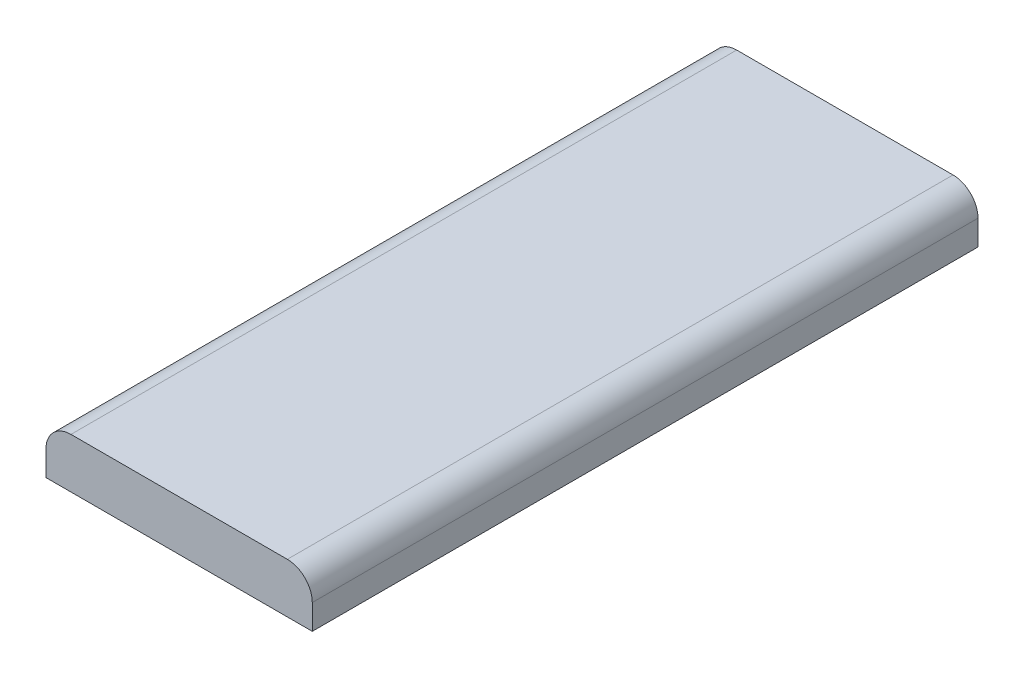
ISO-10303-21;
HEADER;
FILE_DESCRIPTION(('STEP AP214'),'2;1');
FILE_NAME('part.step','',(''),(''),'','','');
FILE_SCHEMA(('AUTOMOTIVE_DESIGN { 1 0 10303 214 1 1 1 1 }'));
ENDSEC;
DATA;
#1=APPLICATION_CONTEXT('core data for automotive mechanical design processes');
#2=APPLICATION_PROTOCOL_DEFINITION('international standard','automotive_design',2000,#1);
#3=PRODUCT_CONTEXT('',#1,'mechanical');
#4=PRODUCT('Part','Part','',(#3));
#5=PRODUCT_RELATED_PRODUCT_CATEGORY('part','',(#4));
#6=PRODUCT_DEFINITION_FORMATION('','',#4);
#7=PRODUCT_DEFINITION_CONTEXT('part definition',#1,'design');
#8=PRODUCT_DEFINITION('design','',#6,#7);
#9=PRODUCT_DEFINITION_SHAPE('','',#8);
#10=(LENGTH_UNIT() NAMED_UNIT(*) SI_UNIT(.MILLI.,.METRE.));
#11=(NAMED_UNIT(*) PLANE_ANGLE_UNIT() SI_UNIT($,.RADIAN.));
#12=(NAMED_UNIT(*) SI_UNIT($,.STERADIAN.) SOLID_ANGLE_UNIT());
#13=UNCERTAINTY_MEASURE_WITH_UNIT(LENGTH_MEASURE(1.E-05),#10,'distance_accuracy_value','');
#14=(GEOMETRIC_REPRESENTATION_CONTEXT(3) GLOBAL_UNCERTAINTY_ASSIGNED_CONTEXT((#13)) GLOBAL_UNIT_ASSIGNED_CONTEXT((#10,
#11,#12)) REPRESENTATION_CONTEXT('',''));
#15=CARTESIAN_POINT('',(0.,0.,0.));
#16=DIRECTION('',(0.,0.,1.));
#17=DIRECTION('',(1.,0.,0.));
#18=AXIS2_PLACEMENT_3D('',#15,#16,#17);
#19=CARTESIAN_POINT('',(10.,3.75,-25.));
#20=DIRECTION('',(-1.,0.,0.));
#21=DIRECTION('',(0.,0.,1.));
#22=AXIS2_PLACEMENT_3D('',#19,#20,#21);
#23=PLANE('',#22);
#24=DIRECTION('',(0.,-1.,0.));
#25=VECTOR('',#24,1.);
#26=CARTESIAN_POINT('',(10.,3.75,-25.));
#27=LINE('',#26,#25);
#28=CARTESIAN_POINT('',(10.,1.875,-25.));
#29=VERTEX_POINT('',#28);
#30=CARTESIAN_POINT('',(10.,0.,-25.));
#31=VERTEX_POINT('',#30);
#32=EDGE_CURVE('E86',#29,#31,#27,.T.);
#33=ORIENTED_EDGE('',*,*,#32,.F.);
#34=DIRECTION('',(0.,0.,-1.));
#35=VECTOR('',#34,1.);
#36=CARTESIAN_POINT('',(10.,1.875,25.));
#37=LINE('',#36,#35);
#38=CARTESIAN_POINT('',(10.,1.875,25.));
#39=VERTEX_POINT('',#38);
#40=EDGE_CURVE('E11',#29,#39,#37,.F.);
#41=ORIENTED_EDGE('',*,*,#40,.T.);
#42=DIRECTION('',(0.,-1.,0.));
#43=VECTOR('',#42,1.);
#44=CARTESIAN_POINT('',(10.,3.75,25.));
#45=LINE('',#44,#43);
#46=CARTESIAN_POINT('',(10.,0.,25.));
#47=VERTEX_POINT('',#46);
#48=EDGE_CURVE('E106',#39,#47,#45,.T.);
#49=ORIENTED_EDGE('',*,*,#48,.T.);
#50=DIRECTION('',(0.,0.,-1.));
#51=VECTOR('',#50,1.);
#52=CARTESIAN_POINT('',(10.,0.,-25.));
#53=LINE('',#52,#51);
#54=EDGE_CURVE('E101',#47,#31,#53,.T.);
#55=ORIENTED_EDGE('',*,*,#54,.T.);
#56=EDGE_LOOP('',(#33,#41,#49,#55));
#57=FACE_BOUND('',#56,.T.);
#58=ADVANCED_FACE('F35',(#57),#23,.F.);
#59=CARTESIAN_POINT('',(-10.,3.75,-25.));
#60=DIRECTION('',(0.,0.,1.));
#61=DIRECTION('',(1.,0.,0.));
#62=AXIS2_PLACEMENT_3D('',#59,#60,#61);
#63=PLANE('',#62);
#64=DIRECTION('',(0.,-1.,0.));
#65=VECTOR('',#64,1.);
#66=CARTESIAN_POINT('',(-10.,3.75,-25.));
#67=LINE('',#66,#65);
#68=CARTESIAN_POINT('',(-10.,1.875,-25.));
#69=VERTEX_POINT('',#68);
#70=CARTESIAN_POINT('',(-10.,0.,-25.));
#71=VERTEX_POINT('',#70);
#72=EDGE_CURVE('E95',#69,#71,#67,.T.);
#73=ORIENTED_EDGE('',*,*,#72,.F.);
#74=CARTESIAN_POINT('',(-8.125,1.875,-25.));
#75=DIRECTION('',(0.,0.,1.));
#76=DIRECTION('',(1.,0.,0.));
#77=AXIS2_PLACEMENT_3D('',#74,#75,#76);
#78=CIRCLE('',#77,1.875);
#79=CARTESIAN_POINT('',(-8.125,3.75,-25.));
#80=VERTEX_POINT('',#79);
#81=EDGE_CURVE('E43',#69,#80,#78,.F.);
#82=ORIENTED_EDGE('',*,*,#81,.T.);
#83=DIRECTION('',(-1.,0.,0.));
#84=VECTOR('',#83,1.);
#85=CARTESIAN_POINT('',(-10.,3.75,-25.));
#86=LINE('',#85,#84);
#87=CARTESIAN_POINT('',(8.125,3.75,-25.));
#88=VERTEX_POINT('',#87);
#89=EDGE_CURVE('E116',#88,#80,#86,.T.);
#90=ORIENTED_EDGE('',*,*,#89,.F.);
#91=CARTESIAN_POINT('',(8.125,1.875,-25.));
#92=DIRECTION('',(0.,0.,1.));
#93=DIRECTION('',(1.,0.,0.));
#94=AXIS2_PLACEMENT_3D('',#91,#92,#93);
#95=CIRCLE('',#94,1.875);
#96=EDGE_CURVE('E50',#88,#29,#95,.F.);
#97=ORIENTED_EDGE('',*,*,#96,.T.);
#98=ORIENTED_EDGE('',*,*,#32,.T.);
#99=DIRECTION('',(-1.,0.,0.));
#100=VECTOR('',#99,1.);
#101=CARTESIAN_POINT('',(-10.,0.,-25.));
#102=LINE('',#101,#100);
#103=EDGE_CURVE('E89',#31,#71,#102,.T.);
#104=ORIENTED_EDGE('',*,*,#103,.T.);
#105=EDGE_LOOP('',(#73,#82,#90,#97,#98,#104));
#106=FACE_BOUND('',#105,.T.);
#107=ADVANCED_FACE('F88',(#106),#63,.F.);
#108=CARTESIAN_POINT('',(-10.,3.75,-25.));
#109=DIRECTION('',(1.,0.,0.));
#110=DIRECTION('',(0.,0.,-1.));
#111=AXIS2_PLACEMENT_3D('',#108,#109,#110);
#112=PLANE('',#111);
#113=DIRECTION('',(0.,-1.,0.));
#114=VECTOR('',#113,1.);
#115=CARTESIAN_POINT('',(-9.99999999999999,3.75,25.));
#116=LINE('',#115,#114);
#117=CARTESIAN_POINT('',(-9.99999999999999,1.875,25.));
#118=VERTEX_POINT('',#117);
#119=CARTESIAN_POINT('',(-9.99999999999999,0.,25.));
#120=VERTEX_POINT('',#119);
#121=EDGE_CURVE('E118',#118,#120,#116,.T.);
#122=ORIENTED_EDGE('',*,*,#121,.F.);
#123=DIRECTION('',(0.,0.,1.));
#124=VECTOR('',#123,1.);
#125=CARTESIAN_POINT('',(-10.,1.875,-25.));
#126=LINE('',#125,#124);
#127=EDGE_CURVE('E58',#118,#69,#126,.F.);
#128=ORIENTED_EDGE('',*,*,#127,.T.);
#129=ORIENTED_EDGE('',*,*,#72,.T.);
#130=DIRECTION('',(0.,0.,1.));
#131=VECTOR('',#130,1.);
#132=CARTESIAN_POINT('',(-10.,0.,-25.));
#133=LINE('',#132,#131);
#134=EDGE_CURVE('E103',#71,#120,#133,.T.);
#135=ORIENTED_EDGE('',*,*,#134,.T.);
#136=EDGE_LOOP('',(#122,#128,#129,#135));
#137=FACE_BOUND('',#136,.T.);
#138=ADVANCED_FACE('F143',(#137),#112,.F.);
#139=CARTESIAN_POINT('',(-9.99999999999999,3.75,25.));
#140=DIRECTION('',(0.,0.,-1.));
#141=DIRECTION('',(-1.,0.,0.));
#142=AXIS2_PLACEMENT_3D('',#139,#140,#141);
#143=PLANE('',#142);
#144=DIRECTION('',(1.,0.,0.));
#145=VECTOR('',#144,1.);
#146=CARTESIAN_POINT('',(-9.99999999999999,3.75,25.));
#147=LINE('',#146,#145);
#148=CARTESIAN_POINT('',(-8.12499999999999,3.75,25.));
#149=VERTEX_POINT('',#148);
#150=CARTESIAN_POINT('',(8.12500000000001,3.75,25.));
#151=VERTEX_POINT('',#150);
#152=EDGE_CURVE('E110',#149,#151,#147,.T.);
#153=ORIENTED_EDGE('',*,*,#152,.F.);
#154=CARTESIAN_POINT('',(-8.12499999999999,1.875,25.));
#155=DIRECTION('',(0.,0.,-1.));
#156=DIRECTION('',(-1.,0.,0.));
#157=AXIS2_PLACEMENT_3D('',#154,#155,#156);
#158=CIRCLE('',#157,1.875);
#159=EDGE_CURVE('E128',#149,#118,#158,.F.);
#160=ORIENTED_EDGE('',*,*,#159,.T.);
#161=ORIENTED_EDGE('',*,*,#121,.T.);
#162=DIRECTION('',(1.,0.,0.));
#163=VECTOR('',#162,1.);
#164=CARTESIAN_POINT('',(-9.99999999999999,0.,25.));
#165=LINE('',#164,#163);
#166=EDGE_CURVE('E114',#120,#47,#165,.T.);
#167=ORIENTED_EDGE('',*,*,#166,.T.);
#168=ORIENTED_EDGE('',*,*,#48,.F.);
#169=CARTESIAN_POINT('',(8.12500000000001,1.875,25.));
#170=DIRECTION('',(0.,0.,-1.));
#171=DIRECTION('',(-1.,0.,0.));
#172=AXIS2_PLACEMENT_3D('',#169,#170,#171);
#173=CIRCLE('',#172,1.875);
#174=EDGE_CURVE('E126',#39,#151,#173,.F.);
#175=ORIENTED_EDGE('',*,*,#174,.T.);
#176=EDGE_LOOP('',(#153,#160,#161,#167,#168,#175));
#177=FACE_BOUND('',#176,.T.);
#178=ADVANCED_FACE('F142',(#177),#143,.F.);
#179=CARTESIAN_POINT('',(0.,3.75,0.));
#180=DIRECTION('',(0.,1.,0.));
#181=DIRECTION('',(0.,0.,1.));
#182=AXIS2_PLACEMENT_3D('',#179,#180,#181);
#183=PLANE('',#182);
#184=ORIENTED_EDGE('',*,*,#89,.T.);
#185=DIRECTION('',(0.,0.,1.));
#186=VECTOR('',#185,1.);
#187=CARTESIAN_POINT('',(-8.12499999999999,3.75,25.));
#188=LINE('',#187,#186);
#189=EDGE_CURVE('E123',#80,#149,#188,.T.);
#190=ORIENTED_EDGE('',*,*,#189,.T.);
#191=ORIENTED_EDGE('',*,*,#152,.T.);
#192=DIRECTION('',(0.,0.,-1.));
#193=VECTOR('',#192,1.);
#194=CARTESIAN_POINT('',(8.125,3.75,-25.));
#195=LINE('',#194,#193);
#196=EDGE_CURVE('E94',#151,#88,#195,.T.);
#197=ORIENTED_EDGE('',*,*,#196,.T.);
#198=EDGE_LOOP('',(#184,#190,#191,#197));
#199=FACE_BOUND('',#198,.T.);
#200=ADVANCED_FACE('F136',(#199),#183,.T.);
#201=CARTESIAN_POINT('',(0.,0.,0.));
#202=DIRECTION('',(0.,1.,0.));
#203=DIRECTION('',(0.,0.,1.));
#204=AXIS2_PLACEMENT_3D('',#201,#202,#203);
#205=PLANE('',#204);
#206=ORIENTED_EDGE('',*,*,#54,.F.);
#207=ORIENTED_EDGE('',*,*,#166,.F.);
#208=ORIENTED_EDGE('',*,*,#134,.F.);
#209=ORIENTED_EDGE('',*,*,#103,.F.);
#210=EDGE_LOOP('',(#206,#207,#208,#209));
#211=FACE_BOUND('',#210,.T.);
#212=ADVANCED_FACE('F99',(#211),#205,.F.);
#213=CARTESIAN_POINT('',(-8.125,1.875,0.));
#214=DIRECTION('',(0.,0.,-1.));
#215=DIRECTION('',(-1.,0.,0.));
#216=AXIS2_PLACEMENT_3D('',#213,#214,#215);
#217=CYLINDRICAL_SURFACE('',#216,1.875);
#218=ORIENTED_EDGE('',*,*,#81,.F.);
#219=ORIENTED_EDGE('',*,*,#127,.F.);
#220=ORIENTED_EDGE('',*,*,#159,.F.);
#221=ORIENTED_EDGE('',*,*,#189,.F.);
#222=EDGE_LOOP('',(#218,#219,#220,#221));
#223=FACE_BOUND('',#222,.T.);
#224=ADVANCED_FACE('F140',(#223),#217,.T.);
#225=CARTESIAN_POINT('',(8.125,1.875,0.));
#226=DIRECTION('',(0.,0.,1.));
#227=DIRECTION('',(1.,0.,0.));
#228=AXIS2_PLACEMENT_3D('',#225,#226,#227);
#229=CYLINDRICAL_SURFACE('',#228,1.875);
#230=ORIENTED_EDGE('',*,*,#174,.F.);
#231=ORIENTED_EDGE('',*,*,#40,.F.);
#232=ORIENTED_EDGE('',*,*,#96,.F.);
#233=ORIENTED_EDGE('',*,*,#196,.F.);
#234=EDGE_LOOP('',(#230,#231,#232,#233));
#235=FACE_BOUND('',#234,.T.);
#236=ADVANCED_FACE('F37',(#235),#229,.T.);
#237=CLOSED_SHELL('',(#58,#107,#138,#178,#200,#212,#224,#236));
#238=MANIFOLD_SOLID_BREP('B2',#237);
#239=ADVANCED_BREP_SHAPE_REPRESENTATION('',(#18,#238),#14);
#240=SHAPE_DEFINITION_REPRESENTATION(#9,#239);
ENDSEC;
END-ISO-10303-21;
